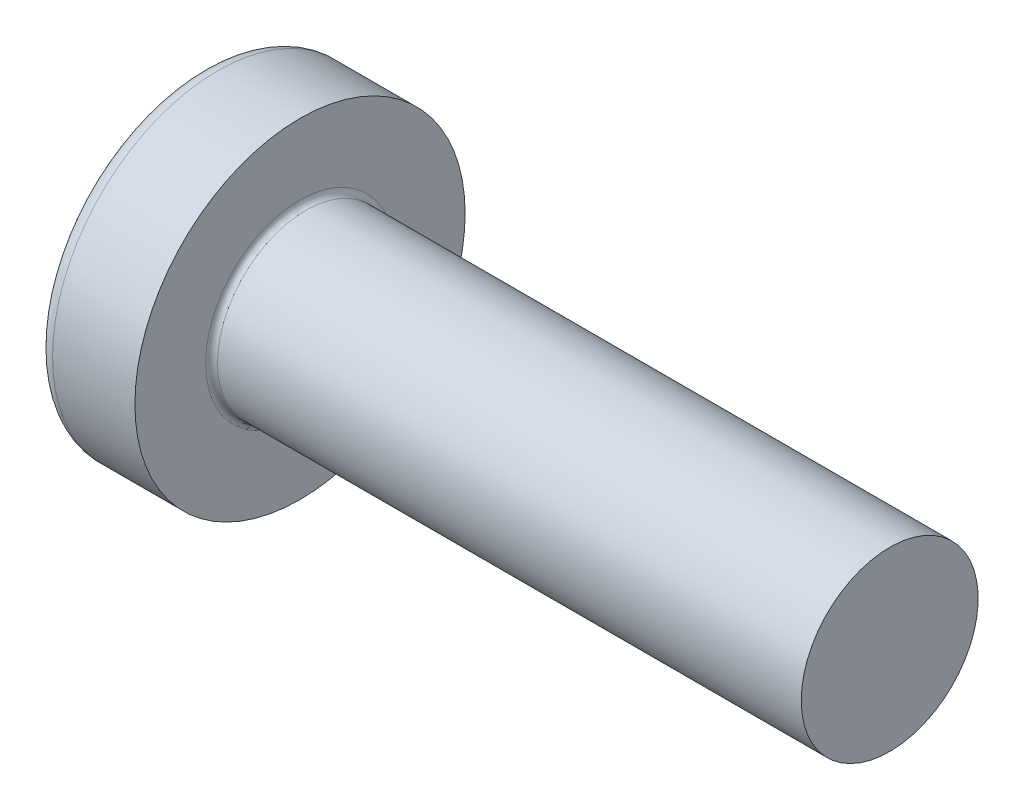
ISO-10303-21;
HEADER;
FILE_DESCRIPTION(('STEP AP214'),'2;1');
FILE_NAME('part.step','',(''),(''),'','','');
FILE_SCHEMA(('AUTOMOTIVE_DESIGN { 1 0 10303 214 1 1 1 1 }'));
ENDSEC;
DATA;
#1=APPLICATION_CONTEXT('core data for automotive mechanical design processes');
#2=APPLICATION_PROTOCOL_DEFINITION('international standard','automotive_design',2000,#1);
#3=PRODUCT_CONTEXT('',#1,'mechanical');
#4=PRODUCT('Part','Part','',(#3));
#5=PRODUCT_RELATED_PRODUCT_CATEGORY('part','',(#4));
#6=PRODUCT_DEFINITION_FORMATION('','',#4);
#7=PRODUCT_DEFINITION_CONTEXT('part definition',#1,'design');
#8=PRODUCT_DEFINITION('design','',#6,#7);
#9=PRODUCT_DEFINITION_SHAPE('','',#8);
#10=(LENGTH_UNIT() NAMED_UNIT(*) SI_UNIT(.MILLI.,.METRE.));
#11=(NAMED_UNIT(*) PLANE_ANGLE_UNIT() SI_UNIT($,.RADIAN.));
#12=(NAMED_UNIT(*) SI_UNIT($,.STERADIAN.) SOLID_ANGLE_UNIT());
#13=UNCERTAINTY_MEASURE_WITH_UNIT(LENGTH_MEASURE(1.E-05),#10,'distance_accuracy_value','');
#14=(GEOMETRIC_REPRESENTATION_CONTEXT(3) GLOBAL_UNCERTAINTY_ASSIGNED_CONTEXT((#13)) GLOBAL_UNIT_ASSIGNED_CONTEXT((#10,
#11,#12)) REPRESENTATION_CONTEXT('',''));
#15=CARTESIAN_POINT('',(0.,0.,0.));
#16=DIRECTION('',(0.,0.,1.));
#17=DIRECTION('',(1.,0.,0.));
#18=AXIS2_PLACEMENT_3D('',#15,#16,#17);
#19=CARTESIAN_POINT('',(5.,0.,0.));
#20=DIRECTION('',(-1.,0.,0.));
#21=DIRECTION('',(0.,1.,0.));
#22=AXIS2_PLACEMENT_3D('',#19,#20,#21);
#23=SPHERICAL_SURFACE('',#22,5.);
#24=CARTESIAN_POINT('',(0.775371598933733,0.,0.));
#25=DIRECTION('',(-1.,0.,0.));
#26=DIRECTION('',(0.,0.,1.));
#27=AXIS2_PLACEMENT_3D('',#24,#25,#26);
#28=CIRCLE('',#27,2.67441860465116);
#29=CARTESIAN_POINT('',(0.775371598933733,0.,2.67441860465116));
#30=VERTEX_POINT('',#29);
#31=EDGE_CURVE('E242',#30,#30,#28,.T.);
#32=ORIENTED_EDGE('',*,*,#31,.T.);
#33=EDGE_LOOP('',(#32));
#34=FACE_BOUND('',#33,.T.);
#35=CARTESIAN_POINT('',(0.0457951200896417,0.,0.));
#36=DIRECTION('',(1.,0.,0.));
#37=DIRECTION('',(0.,0.,-1.));
#38=AXIS2_PLACEMENT_3D('',#35,#36,#37);
#39=CIRCLE('',#38,0.675169614150692);
#40=CARTESIAN_POINT('',(0.0457951200896426,-0.369999999999998,-0.564760133040918));
#41=VERTEX_POINT('',#40);
#42=CARTESIAN_POINT('',(0.0457951200896417,-0.564760133040916,-0.37));
#43=VERTEX_POINT('',#42);
#44=EDGE_CURVE('E378',#41,#43,#39,.F.);
#45=ORIENTED_EDGE('',*,*,#44,.F.);
#46=CARTESIAN_POINT('',(5.,-0.37,0.));
#47=DIRECTION('',(0.,1.,0.));
#48=DIRECTION('',(0.,0.,1.));
#49=AXIS2_PLACEMENT_3D('',#46,#47,#48);
#50=CIRCLE('',#49,4.98629120689917);
#51=CARTESIAN_POINT('',(0.187869734228639,-0.369999999999995,-1.30633162146802));
#52=VERTEX_POINT('',#51);
#53=EDGE_CURVE('E304',#52,#41,#50,.T.);
#54=ORIENTED_EDGE('',*,*,#53,.F.);
#55=CARTESIAN_POINT('',(4.56358262530798,0.,0.875317983305919));
#56=DIRECTION('',(0.446197753347436,0.,-0.894934391398443));
#57=DIRECTION('',(-0.894934391398443,0.,-0.446197753347436));
#58=AXIS2_PLACEMENT_3D('',#55,#56,#57);
#59=CIRCLE('',#58,4.90340272700175);
#60=CARTESIAN_POINT('',(0.18786973422864,0.370000000000005,-1.30633162146802));
#61=VERTEX_POINT('',#60);
#62=EDGE_CURVE('E276',#52,#61,#59,.T.);
#63=ORIENTED_EDGE('',*,*,#62,.T.);
#64=CARTESIAN_POINT('',(5.,0.37,0.));
#65=DIRECTION('',(0.,-1.,0.));
#66=DIRECTION('',(0.,0.,-1.));
#67=AXIS2_PLACEMENT_3D('',#64,#65,#66);
#68=CIRCLE('',#67,4.98629120689917);
#69=CARTESIAN_POINT('',(0.0457951200896425,0.370000000000002,-0.564760133040916));
#70=VERTEX_POINT('',#69);
#71=EDGE_CURVE('E331',#70,#61,#68,.T.);
#72=ORIENTED_EDGE('',*,*,#71,.F.);
#73=CARTESIAN_POINT('',(0.0457951200896417,0.564760133040915,-0.37));
#74=VERTEX_POINT('',#73);
#75=EDGE_CURVE('E397',#74,#70,#39,.F.);
#76=ORIENTED_EDGE('',*,*,#75,.F.);
#77=CARTESIAN_POINT('',(5.,0.,-0.37));
#78=DIRECTION('',(0.,0.,1.));
#79=DIRECTION('',(1.,0.,0.));
#80=AXIS2_PLACEMENT_3D('',#77,#78,#79);
#81=CIRCLE('',#80,4.98629120689917);
#82=CARTESIAN_POINT('',(0.187869734228641,1.30633162146802,-0.37));
#83=VERTEX_POINT('',#82);
#84=EDGE_CURVE('E270',#83,#74,#81,.T.);
#85=ORIENTED_EDGE('',*,*,#84,.F.);
#86=CARTESIAN_POINT('',(4.56358262530798,-0.87531798330592,0.));
#87=DIRECTION('',(0.446197753347436,0.894934391398443,0.));
#88=DIRECTION('',(-0.894934391398442,0.446197753347436,0.));
#89=AXIS2_PLACEMENT_3D('',#86,#87,#88);
#90=CIRCLE('',#89,4.90340272700175);
#91=CARTESIAN_POINT('',(0.18786973422864,1.30633162146802,0.37));
#92=VERTEX_POINT('',#91);
#93=EDGE_CURVE('E273',#83,#92,#90,.T.);
#94=ORIENTED_EDGE('',*,*,#93,.T.);
#95=CARTESIAN_POINT('',(5.,0.,0.37));
#96=DIRECTION('',(0.,0.,-1.));
#97=DIRECTION('',(0.,1.,0.));
#98=AXIS2_PLACEMENT_3D('',#95,#96,#97);
#99=CIRCLE('',#98,4.98629120689917);
#100=CARTESIAN_POINT('',(0.0457951200896417,0.564760133040915,0.37));
#101=VERTEX_POINT('',#100);
#102=EDGE_CURVE('E266',#101,#92,#99,.T.);
#103=ORIENTED_EDGE('',*,*,#102,.F.);
#104=CARTESIAN_POINT('',(0.0457951200896434,0.369999999999998,0.564760133040918));
#105=VERTEX_POINT('',#104);
#106=EDGE_CURVE('E396',#105,#101,#39,.F.);
#107=ORIENTED_EDGE('',*,*,#106,.F.);
#108=CARTESIAN_POINT('',(0.18786973422864,0.369999999999995,1.30633162146802));
#109=VERTEX_POINT('',#108);
#110=EDGE_CURVE('E286',#109,#105,#68,.T.);
#111=ORIENTED_EDGE('',*,*,#110,.F.);
#112=CARTESIAN_POINT('',(4.56358262530798,0.,-0.87531798330592));
#113=DIRECTION('',(0.446197753347436,0.,0.894934391398443));
#114=DIRECTION('',(0.894934391398442,0.,-0.446197753347436));
#115=AXIS2_PLACEMENT_3D('',#112,#113,#114);
#116=CIRCLE('',#115,4.90340272700175);
#117=CARTESIAN_POINT('',(0.18786973422864,-0.370000000000005,1.30633162146802));
#118=VERTEX_POINT('',#117);
#119=EDGE_CURVE('E53',#109,#118,#116,.T.);
#120=ORIENTED_EDGE('',*,*,#119,.T.);
#121=CARTESIAN_POINT('',(0.0457951200896421,-0.370000000000002,0.564760133040916));
#122=VERTEX_POINT('',#121);
#123=EDGE_CURVE('E283',#122,#118,#50,.T.);
#124=ORIENTED_EDGE('',*,*,#123,.F.);
#125=CARTESIAN_POINT('',(0.0457951200896417,-0.564760133040916,0.37));
#126=VERTEX_POINT('',#125);
#127=EDGE_CURVE('E436',#126,#122,#39,.F.);
#128=ORIENTED_EDGE('',*,*,#127,.F.);
#129=CARTESIAN_POINT('',(0.187869734228639,-1.30633162146802,0.37));
#130=VERTEX_POINT('',#129);
#131=EDGE_CURVE('E267',#130,#126,#99,.T.);
#132=ORIENTED_EDGE('',*,*,#131,.F.);
#133=CARTESIAN_POINT('',(4.56358262530798,0.875317983305919,0.));
#134=DIRECTION('',(0.446197753347436,-0.894934391398443,0.));
#135=DIRECTION('',(0.894934391398443,0.446197753347436,0.));
#136=AXIS2_PLACEMENT_3D('',#133,#134,#135);
#137=CIRCLE('',#136,4.90340272700175);
#138=CARTESIAN_POINT('',(0.18786973422864,-1.30633162146802,-0.37));
#139=VERTEX_POINT('',#138);
#140=EDGE_CURVE('E263',#130,#139,#137,.T.);
#141=ORIENTED_EDGE('',*,*,#140,.T.);
#142=EDGE_CURVE('E68',#43,#139,#81,.T.);
#143=ORIENTED_EDGE('',*,*,#142,.F.);
#144=EDGE_LOOP('',(#45,#54,#63,#72,#76,#85,#94,#103,#107,#111,#120,#124,#128,#132,#141,#143));
#145=FACE_BOUND('',#144,.T.);
#146=ADVANCED_FACE('F39',(#34,#145),#23,.T.);
#147=CARTESIAN_POINT('',(1.75,0.527482331818931,-0.37));
#148=DIRECTION('',(0.,0.,1.));
#149=DIRECTION('',(1.,0.,0.));
#150=AXIS2_PLACEMENT_3D('',#147,#148,#149);
#151=PLANE('',#150);
#152=ORIENTED_EDGE('',*,*,#84,.T.);
#153=CARTESIAN_POINT('',(-0.987293237053716,0.649401255967161,-0.37));
#154=CARTESIAN_POINT('',(-0.781914975317084,0.632865887002871,-0.37));
#155=CARTESIAN_POINT('',(-0.576547882393372,0.616188977635081,-0.37));
#156=CARTESIAN_POINT('',(-0.165841599226327,0.582441031964227,-0.37));
#157=CARTESIAN_POINT('',(0.0394975903090452,0.56536998705488,-0.37));
#158=CARTESIAN_POINT('',(0.450133475422572,0.530723441326535,-0.37));
#159=CARTESIAN_POINT('',(0.655430171010573,0.513147940624557,-0.37));
#160=CARTESIAN_POINT('',(1.06596140177934,0.477314957985794,-0.37));
#161=CARTESIAN_POINT('',(1.2711959378071,0.459057485806066,-0.37));
#162=CARTESIAN_POINT('',(1.61065292365626,0.428051938688768,-0.37));
#163=CARTESIAN_POINT('',(1.74490059995643,0.415580824990931,-0.37));
#164=CARTESIAN_POINT('',(2.01334321762763,0.390092023404979,-0.37));
#165=CARTESIAN_POINT('',(2.14753815934577,0.377074339177353,-0.37));
#166=CARTESIAN_POINT('',(2.41586354151957,0.350315629452843,-0.37));
#167=CARTESIAN_POINT('',(2.5499939784531,0.33657456817765,-0.37));
#168=CARTESIAN_POINT('',(2.81814173295471,0.308004077741875,-0.37));
#169=CARTESIAN_POINT('',(2.95215904765134,0.293174621747065,-0.37));
#170=CARTESIAN_POINT('',(3.0860955068368,0.277618485071816,-0.37));
#171=B_SPLINE_CURVE_WITH_KNOTS('',3,(#153,#154,#155,#156,#157,#158,#159,#160,#161,#162,#163,
#164,#165,#166,#167,#168,#169,#170),.UNSPECIFIED.,.F.,.F.,(4,2,2,2,2,2,2,2,4),(0.,
0.618128793984691,1.23627109812525,1.85441325887562,2.4725465791681,2.87702276218609,
3.28149623678161,3.68598973550942,4.09049321032311),.UNSPECIFIED.);
#172=CARTESIAN_POINT('',(1.75,0.415013252800437,-0.370000000000001));
#173=VERTEX_POINT('',#172);
#174=EDGE_CURVE('E420',#74,#173,#171,.T.);
#175=ORIENTED_EDGE('',*,*,#174,.T.);
#176=DIRECTION('',(0.,1.,0.));
#177=VECTOR('',#176,1.);
#178=CARTESIAN_POINT('',(1.75,-0.527482331818931,-0.37));
#179=LINE('',#178,#177);
#180=CARTESIAN_POINT('',(1.75,0.527482331818931,-0.37));
#181=VERTEX_POINT('',#180);
#182=EDGE_CURVE('E360',#173,#181,#179,.T.);
#183=ORIENTED_EDGE('',*,*,#182,.T.);
#184=DIRECTION('',(0.894934391398442,-0.446197753347436,0.));
#185=VECTOR('',#184,1.);
#186=CARTESIAN_POINT('',(0.,1.4,-0.37));
#187=LINE('',#186,#185);
#188=EDGE_CURVE('E243',#83,#181,#187,.T.);
#189=ORIENTED_EDGE('',*,*,#188,.F.);
#190=EDGE_LOOP('',(#152,#175,#183,#189));
#191=FACE_BOUND('',#190,.T.);
#192=ADVANCED_FACE('F198',(#191),#151,.T.);
#193=CARTESIAN_POINT('',(1.75,-0.527482331818931,-0.37));
#194=VERTEX_POINT('',#193);
#195=CARTESIAN_POINT('',(1.75,-0.415013252800437,-0.370000000000001));
#196=VERTEX_POINT('',#195);
#197=EDGE_CURVE('E251',#194,#196,#179,.T.);
#198=ORIENTED_EDGE('',*,*,#197,.T.);
#199=CARTESIAN_POINT('',(-0.987293237053716,-0.649401255967161,-0.37));
#200=CARTESIAN_POINT('',(-0.781914975317084,-0.632865887002871,-0.37));
#201=CARTESIAN_POINT('',(-0.576547882393372,-0.616188977635081,-0.37));
#202=CARTESIAN_POINT('',(-0.165841599226327,-0.582441031964227,-0.37));
#203=CARTESIAN_POINT('',(0.0394975903090452,-0.56536998705488,-0.37));
#204=CARTESIAN_POINT('',(0.450133475422572,-0.530723441326535,-0.37));
#205=CARTESIAN_POINT('',(0.655430171010573,-0.513147940624557,-0.37));
#206=CARTESIAN_POINT('',(1.06596140177934,-0.477314957985794,-0.37));
#207=CARTESIAN_POINT('',(1.2711959378071,-0.459057485806066,-0.37));
#208=CARTESIAN_POINT('',(1.61065292365626,-0.428051938688768,-0.37));
#209=CARTESIAN_POINT('',(1.74490059995643,-0.415580824990931,-0.37));
#210=CARTESIAN_POINT('',(2.01334321762763,-0.390092023404979,-0.37));
#211=CARTESIAN_POINT('',(2.14753815934577,-0.377074339177353,-0.37));
#212=CARTESIAN_POINT('',(2.41586354151957,-0.350315629452843,-0.37));
#213=CARTESIAN_POINT('',(2.5499939784531,-0.33657456817765,-0.37));
#214=CARTESIAN_POINT('',(2.81814173295471,-0.308004077741875,-0.37));
#215=CARTESIAN_POINT('',(2.95215904765134,-0.293174621747065,-0.37));
#216=CARTESIAN_POINT('',(3.0860955068368,-0.277618485071816,-0.37));
#217=B_SPLINE_CURVE_WITH_KNOTS('',3,(#199,#200,#201,#202,#203,#204,#205,#206,#207,#208,#209,
#210,#211,#212,#213,#214,#215,#216),.UNSPECIFIED.,.F.,.F.,(4,2,2,2,2,2,2,2,4),(0.,
0.618128793984691,1.23627109812525,1.85441325887562,2.4725465791681,2.87702276218609,
3.28149623678161,3.68598973550942,4.09049321032311),.UNSPECIFIED.);
#218=EDGE_CURVE('E395',#196,#43,#217,.F.);
#219=ORIENTED_EDGE('',*,*,#218,.T.);
#220=ORIENTED_EDGE('',*,*,#142,.T.);
#221=DIRECTION('',(0.894934391398442,0.446197753347436,0.));
#222=VECTOR('',#221,1.);
#223=CARTESIAN_POINT('',(0.,-1.4,-0.37));
#224=LINE('',#223,#222);
#225=EDGE_CURVE('E334',#139,#194,#224,.T.);
#226=ORIENTED_EDGE('',*,*,#225,.T.);
#227=EDGE_LOOP('',(#198,#219,#220,#226));
#228=FACE_BOUND('',#227,.T.);
#229=ADVANCED_FACE('F204',(#228),#151,.T.);
#230=CARTESIAN_POINT('',(1.75,-0.527482331818931,0.37));
#231=DIRECTION('',(0.,0.,-1.));
#232=DIRECTION('',(0.,1.,0.));
#233=AXIS2_PLACEMENT_3D('',#230,#231,#232);
#234=PLANE('',#233);
#235=DIRECTION('',(0.,-1.,0.));
#236=VECTOR('',#235,1.);
#237=CARTESIAN_POINT('',(1.75,0.527482331818931,0.37));
#238=LINE('',#237,#236);
#239=CARTESIAN_POINT('',(1.75,0.527482331818931,0.37));
#240=VERTEX_POINT('',#239);
#241=CARTESIAN_POINT('',(1.75,0.415013252800437,0.370000000000001));
#242=VERTEX_POINT('',#241);
#243=EDGE_CURVE('E343',#240,#242,#238,.T.);
#244=ORIENTED_EDGE('',*,*,#243,.T.);
#245=CARTESIAN_POINT('',(-0.987293237053716,0.649401255967161,0.37));
#246=CARTESIAN_POINT('',(-0.781914975317084,0.632865887002871,0.37));
#247=CARTESIAN_POINT('',(-0.576547882393372,0.616188977635081,0.37));
#248=CARTESIAN_POINT('',(-0.165841599226327,0.582441031964227,0.37));
#249=CARTESIAN_POINT('',(0.0394975903090453,0.56536998705488,0.37));
#250=CARTESIAN_POINT('',(0.450133475422572,0.530723441326535,0.37));
#251=CARTESIAN_POINT('',(0.655430171010574,0.513147940624557,0.37));
#252=CARTESIAN_POINT('',(1.06596140177934,0.477314957985794,0.37));
#253=CARTESIAN_POINT('',(1.2711959378071,0.459057485806066,0.37));
#254=CARTESIAN_POINT('',(1.61065292365626,0.428051938688768,0.37));
#255=CARTESIAN_POINT('',(1.74490059995643,0.415580824990931,0.37));
#256=CARTESIAN_POINT('',(2.01334321762763,0.39009202340498,0.37));
#257=CARTESIAN_POINT('',(2.14753815934577,0.377074339177353,0.37));
#258=CARTESIAN_POINT('',(2.41586354151957,0.350315629452843,0.37));
#259=CARTESIAN_POINT('',(2.5499939784531,0.33657456817765,0.37));
#260=CARTESIAN_POINT('',(2.81814173295471,0.308004077741875,0.37));
#261=CARTESIAN_POINT('',(2.95215904765134,0.293174621747065,0.37));
#262=CARTESIAN_POINT('',(3.0860955068368,0.277618485071816,0.37));
#263=B_SPLINE_CURVE_WITH_KNOTS('',3,(#245,#246,#247,#248,#249,#250,#251,#252,#253,#254,#255,
#256,#257,#258,#259,#260,#261,#262),.UNSPECIFIED.,.F.,.F.,(4,2,2,2,2,2,2,2,4),(0.,
0.618128793984691,1.23627109812525,1.85441325887562,2.4725465791681,2.87702276218609,
3.28149623678161,3.68598973550942,4.09049321032311),.UNSPECIFIED.);
#264=EDGE_CURVE('E675',#242,#101,#263,.F.);
#265=ORIENTED_EDGE('',*,*,#264,.T.);
#266=ORIENTED_EDGE('',*,*,#102,.T.);
#267=DIRECTION('',(0.894934391398442,-0.446197753347436,0.));
#268=VECTOR('',#267,1.);
#269=CARTESIAN_POINT('',(0.,1.4,0.37));
#270=LINE('',#269,#268);
#271=EDGE_CURVE('E248',#92,#240,#270,.T.);
#272=ORIENTED_EDGE('',*,*,#271,.T.);
#273=EDGE_LOOP('',(#244,#265,#266,#272));
#274=FACE_BOUND('',#273,.T.);
#275=ADVANCED_FACE('F416',(#274),#234,.T.);
#276=ORIENTED_EDGE('',*,*,#131,.T.);
#277=CARTESIAN_POINT('',(-0.987293237069635,-0.649401255968442,0.37));
#278=CARTESIAN_POINT('',(-0.781914975331301,-0.632865887004023,0.37));
#279=CARTESIAN_POINT('',(-0.576547882405888,-0.616188977636102,0.37));
#280=CARTESIAN_POINT('',(-0.16584159923544,-0.582441031964983,0.37));
#281=CARTESIAN_POINT('',(0.0394975903016338,-0.5653699870555,0.37));
#282=CARTESIAN_POINT('',(0.450133475420601,-0.530723441326706,0.37));
#283=CARTESIAN_POINT('',(0.655430171012341,-0.513147940624409,0.37));
#284=CARTESIAN_POINT('',(1.06596140178858,-0.477314957984981,0.37));
#285=CARTESIAN_POINT('',(1.27119593782008,-0.459057485804908,0.37));
#286=CARTESIAN_POINT('',(1.61065292367297,-0.428051938687225,0.37));
#287=CARTESIAN_POINT('',(1.74490059997313,-0.415580824989368,0.37));
#288=CARTESIAN_POINT('',(2.01334321764434,-0.390092023403371,0.37));
#289=CARTESIAN_POINT('',(2.14753815936247,-0.377074339175718,0.37));
#290=CARTESIAN_POINT('',(2.41586354153627,-0.350315629451146,0.37));
#291=CARTESIAN_POINT('',(2.54999397846979,-0.336574568175918,0.37));
#292=CARTESIAN_POINT('',(2.8181417329714,-0.308004077740054,0.37));
#293=CARTESIAN_POINT('',(2.95215904766802,-0.29317462174519,0.37));
#294=CARTESIAN_POINT('',(3.08609550685347,-0.277618485069873,0.37));
#295=B_SPLINE_CURVE_WITH_KNOTS('',3,(#277,#278,#279,#280,#281,#282,#283,#284,#285,#286,#287,
#288,#289,#290,#291,#292,#293,#294),.UNSPECIFIED.,.F.,.F.,(4,2,2,2,2,2,2,2,4),(0.,
0.61812879398981,1.23627109813549,1.85441325889711,2.47254657920086,2.87702276221884,
3.28149623681437,3.68598973554218,4.09049321035586),.UNSPECIFIED.);
#296=CARTESIAN_POINT('',(1.75,-0.415013252800437,0.37));
#297=VERTEX_POINT('',#296);
#298=EDGE_CURVE('E437',#126,#297,#295,.T.);
#299=ORIENTED_EDGE('',*,*,#298,.T.);
#300=CARTESIAN_POINT('',(1.75,-0.527482331818932,0.37));
#301=VERTEX_POINT('',#300);
#302=EDGE_CURVE('E345',#297,#301,#238,.T.);
#303=ORIENTED_EDGE('',*,*,#302,.T.);
#304=DIRECTION('',(0.894934391398443,0.446197753347436,0.));
#305=VECTOR('',#304,1.);
#306=CARTESIAN_POINT('',(0.,-1.4,0.37));
#307=LINE('',#306,#305);
#308=EDGE_CURVE('E336',#130,#301,#307,.T.);
#309=ORIENTED_EDGE('',*,*,#308,.F.);
#310=EDGE_LOOP('',(#276,#299,#303,#309));
#311=FACE_BOUND('',#310,.T.);
#312=ADVANCED_FACE('F523',(#311),#234,.T.);
#313=CARTESIAN_POINT('',(1.75,0.527482331818931,0.37));
#314=DIRECTION('',(0.446197753347436,0.894934391398443,0.));
#315=DIRECTION('',(-0.894934391398442,0.446197753347436,0.));
#316=AXIS2_PLACEMENT_3D('',#313,#314,#315);
#317=PLANE('',#316);
#318=CARTESIAN_POINT('',(2.6696526882832,0.0689604923233249,0.));
#319=DIRECTION('',(0.446197753347436,0.894934391398443,0.));
#320=DIRECTION('',(-0.894934391398443,0.446197753347436,0.));
#321=AXIS2_PLACEMENT_3D('',#318,#319,#320);
#322=ELLIPSE('',#321,1.10195897609154,0.486831694838766);
#323=CARTESIAN_POINT('',(1.75,0.527482331818932,0.175779377683682));
#324=VERTEX_POINT('',#323);
#325=CARTESIAN_POINT('',(1.75,0.527482331818932,-0.175779377683682));
#326=VERTEX_POINT('',#325);
#327=EDGE_CURVE('E309',#324,#326,#322,.F.);
#328=ORIENTED_EDGE('',*,*,#327,.F.);
#329=DIRECTION('',(0.,0.,-1.));
#330=VECTOR('',#329,1.);
#331=CARTESIAN_POINT('',(1.75,0.527482331818931,0.37));
#332=LINE('',#331,#330);
#333=EDGE_CURVE('E346',#240,#324,#332,.T.);
#334=ORIENTED_EDGE('',*,*,#333,.F.);
#335=ORIENTED_EDGE('',*,*,#271,.F.);
#336=ORIENTED_EDGE('',*,*,#93,.F.);
#337=ORIENTED_EDGE('',*,*,#188,.T.);
#338=EDGE_CURVE('E348',#326,#181,#332,.T.);
#339=ORIENTED_EDGE('',*,*,#338,.F.);
#340=EDGE_LOOP('',(#328,#334,#335,#336,#337,#339));
#341=FACE_BOUND('',#340,.T.);
#342=ADVANCED_FACE('F414',(#341),#317,.F.);
#343=CARTESIAN_POINT('',(0.,-1.4,-0.37));
#344=DIRECTION('',(0.446197753347436,-0.894934391398443,0.));
#345=DIRECTION('',(0.894934391398443,0.446197753347436,0.));
#346=AXIS2_PLACEMENT_3D('',#343,#344,#345);
#347=PLANE('',#346);
#348=CARTESIAN_POINT('',(2.6696526882832,-0.0689604923233252,0.));
#349=DIRECTION('',(0.446197753347436,-0.894934391398443,0.));
#350=DIRECTION('',(-0.894934391398443,-0.446197753347436,0.));
#351=AXIS2_PLACEMENT_3D('',#348,#349,#350);
#352=ELLIPSE('',#351,1.10195897609154,0.486831694838766);
#353=CARTESIAN_POINT('',(1.75,-0.527482331818932,-0.175779377683681));
#354=VERTEX_POINT('',#353);
#355=CARTESIAN_POINT('',(1.75,-0.527482331818932,0.17577937768368));
#356=VERTEX_POINT('',#355);
#357=EDGE_CURVE('E677',#354,#356,#352,.F.);
#358=ORIENTED_EDGE('',*,*,#357,.F.);
#359=DIRECTION('',(0.,0.,1.));
#360=VECTOR('',#359,1.);
#361=CARTESIAN_POINT('',(1.75,-0.527482331818931,-0.37));
#362=LINE('',#361,#360);
#363=EDGE_CURVE('E339',#194,#354,#362,.T.);
#364=ORIENTED_EDGE('',*,*,#363,.F.);
#365=ORIENTED_EDGE('',*,*,#225,.F.);
#366=ORIENTED_EDGE('',*,*,#140,.F.);
#367=ORIENTED_EDGE('',*,*,#308,.T.);
#368=EDGE_CURVE('E342',#356,#301,#362,.T.);
#369=ORIENTED_EDGE('',*,*,#368,.F.);
#370=EDGE_LOOP('',(#358,#364,#365,#366,#367,#369));
#371=FACE_BOUND('',#370,.T.);
#372=ADVANCED_FACE('F510',(#371),#347,.F.);
#373=CARTESIAN_POINT('',(1.75,0.527482331818931,-0.37));
#374=DIRECTION('',(-1.,0.,0.));
#375=DIRECTION('',(0.,0.,1.));
#376=AXIS2_PLACEMENT_3D('',#373,#374,#375);
#377=PLANE('',#376);
#378=DIRECTION('',(0.,1.,0.));
#379=VECTOR('',#378,1.);
#380=CARTESIAN_POINT('',(1.75,-0.370000000000002,0.52748233181893));
#381=LINE('',#380,#379);
#382=CARTESIAN_POINT('',(1.75,-0.370000000000002,0.52748233181893));
#383=VERTEX_POINT('',#382);
#384=CARTESIAN_POINT('',(1.75,-0.175779377683686,0.52748233181893));
#385=VERTEX_POINT('',#384);
#386=EDGE_CURVE('E324',#383,#385,#381,.T.);
#387=ORIENTED_EDGE('',*,*,#386,.T.);
#388=CARTESIAN_POINT('',(1.75,0.,0.));
#389=DIRECTION('',(-1.,0.,0.));
#390=DIRECTION('',(0.,0.,1.));
#391=AXIS2_PLACEMENT_3D('',#388,#389,#390);
#392=CIRCLE('',#391,0.556);
#393=CARTESIAN_POINT('',(1.75,-0.370000000000001,0.415013252800436));
#394=VERTEX_POINT('',#393);
#395=EDGE_CURVE('E705',#394,#385,#392,.T.);
#396=ORIENTED_EDGE('',*,*,#395,.F.);
#397=DIRECTION('',(0.,0.,-1.));
#398=VECTOR('',#397,1.);
#399=CARTESIAN_POINT('',(1.75,-0.370000000000002,0.52748233181893));
#400=LINE('',#399,#398);
#401=EDGE_CURVE('E320',#383,#394,#400,.T.);
#402=ORIENTED_EDGE('',*,*,#401,.F.);
#403=EDGE_LOOP('',(#387,#396,#402));
#404=FACE_BOUND('',#403,.T.);
#405=ADVANCED_FACE('F503',(#404),#377,.T.);
#406=ORIENTED_EDGE('',*,*,#302,.F.);
#407=EDGE_CURVE('E710',#356,#297,#392,.T.);
#408=ORIENTED_EDGE('',*,*,#407,.F.);
#409=ORIENTED_EDGE('',*,*,#368,.T.);
#410=EDGE_LOOP('',(#406,#408,#409));
#411=FACE_BOUND('',#410,.T.);
#412=ADVANCED_FACE('F496',(#411),#377,.T.);
#413=ORIENTED_EDGE('',*,*,#363,.T.);
#414=EDGE_CURVE('E389',#196,#354,#392,.T.);
#415=ORIENTED_EDGE('',*,*,#414,.F.);
#416=ORIENTED_EDGE('',*,*,#197,.F.);
#417=EDGE_LOOP('',(#413,#415,#416));
#418=FACE_BOUND('',#417,.T.);
#419=ADVANCED_FACE('F490',(#418),#377,.T.);
#420=CARTESIAN_POINT('',(1.75,-0.369999999999998,-0.415013252800438));
#421=VERTEX_POINT('',#420);
#422=CARTESIAN_POINT('',(1.75,-0.369999999999998,-0.527482331818933));
#423=VERTEX_POINT('',#422);
#424=EDGE_CURVE('E323',#421,#423,#400,.T.);
#425=ORIENTED_EDGE('',*,*,#424,.F.);
#426=CARTESIAN_POINT('',(1.75,-0.17577937768368,-0.527482331818932));
#427=VERTEX_POINT('',#426);
#428=EDGE_CURVE('E60',#427,#421,#392,.T.);
#429=ORIENTED_EDGE('',*,*,#428,.F.);
#430=DIRECTION('',(0.,-1.,0.));
#431=VECTOR('',#430,1.);
#432=CARTESIAN_POINT('',(1.75,0.370000000000002,-0.52748233181893));
#433=LINE('',#432,#431);
#434=EDGE_CURVE('E319',#427,#423,#433,.T.);
#435=ORIENTED_EDGE('',*,*,#434,.T.);
#436=EDGE_LOOP('',(#425,#429,#435));
#437=FACE_BOUND('',#436,.T.);
#438=ADVANCED_FACE('F384',(#437),#377,.T.);
#439=CARTESIAN_POINT('',(1.75,0.370000000000002,-0.52748233181893));
#440=VERTEX_POINT('',#439);
#441=CARTESIAN_POINT('',(1.75,0.175779377683684,-0.527482331818931));
#442=VERTEX_POINT('',#441);
#443=EDGE_CURVE('E316',#440,#442,#433,.T.);
#444=ORIENTED_EDGE('',*,*,#443,.T.);
#445=CARTESIAN_POINT('',(1.75,0.370000000000001,-0.415013252800436));
#446=VERTEX_POINT('',#445);
#447=EDGE_CURVE('E388',#446,#442,#392,.T.);
#448=ORIENTED_EDGE('',*,*,#447,.F.);
#449=DIRECTION('',(0.,0.,1.));
#450=VECTOR('',#449,1.);
#451=CARTESIAN_POINT('',(1.75,0.370000000000002,-0.52748233181893));
#452=LINE('',#451,#450);
#453=EDGE_CURVE('E328',#440,#446,#452,.T.);
#454=ORIENTED_EDGE('',*,*,#453,.F.);
#455=EDGE_LOOP('',(#444,#448,#454));
#456=FACE_BOUND('',#455,.T.);
#457=ADVANCED_FACE('F478',(#456),#377,.T.);
#458=ORIENTED_EDGE('',*,*,#182,.F.);
#459=EDGE_CURVE('E694',#326,#173,#392,.T.);
#460=ORIENTED_EDGE('',*,*,#459,.F.);
#461=ORIENTED_EDGE('',*,*,#338,.T.);
#462=EDGE_LOOP('',(#458,#460,#461));
#463=FACE_BOUND('',#462,.T.);
#464=ADVANCED_FACE('F471',(#463),#377,.T.);
#465=ORIENTED_EDGE('',*,*,#333,.T.);
#466=EDGE_CURVE('E696',#242,#324,#392,.T.);
#467=ORIENTED_EDGE('',*,*,#466,.F.);
#468=ORIENTED_EDGE('',*,*,#243,.F.);
#469=EDGE_LOOP('',(#465,#467,#468));
#470=FACE_BOUND('',#469,.T.);
#471=ADVANCED_FACE('F465',(#470),#377,.T.);
#472=CARTESIAN_POINT('',(1.75,0.369999999999998,0.527482331818932));
#473=DIRECTION('',(0.,-1.,0.));
#474=DIRECTION('',(1.,0.,0.));
#475=AXIS2_PLACEMENT_3D('',#472,#473,#474);
#476=PLANE('',#475);
#477=ORIENTED_EDGE('',*,*,#110,.T.);
#478=CARTESIAN_POINT('',(-0.987293237069635,0.369999999999998,0.649401255968443));
#479=CARTESIAN_POINT('',(-0.781914975331301,0.369999999999998,0.632865887004024));
#480=CARTESIAN_POINT('',(-0.576547882405888,0.369999999999998,0.616188977636103));
#481=CARTESIAN_POINT('',(-0.16584159923544,0.369999999999998,0.582441031964984));
#482=CARTESIAN_POINT('',(0.0394975903016338,0.369999999999998,0.565369987055501));
#483=CARTESIAN_POINT('',(0.450133475420601,0.369999999999998,0.530723441326707));
#484=CARTESIAN_POINT('',(0.655430171012341,0.369999999999998,0.51314794062441));
#485=CARTESIAN_POINT('',(1.06596140178858,0.369999999999998,0.477314957984982));
#486=CARTESIAN_POINT('',(1.27119593782008,0.369999999999998,0.459057485804909));
#487=CARTESIAN_POINT('',(1.61065292367297,0.369999999999999,0.428051938687226));
#488=CARTESIAN_POINT('',(1.74490059997313,0.369999999999999,0.415580824989369));
#489=CARTESIAN_POINT('',(2.01334321764434,0.369999999999999,0.390092023403372));
#490=CARTESIAN_POINT('',(2.14753815936247,0.369999999999999,0.37707433917572));
#491=CARTESIAN_POINT('',(2.41586354153627,0.369999999999999,0.350315629451147));
#492=CARTESIAN_POINT('',(2.54999397846979,0.369999999999999,0.336574568175919));
#493=CARTESIAN_POINT('',(2.8181417329714,0.369999999999999,0.308004077740055));
#494=CARTESIAN_POINT('',(2.95215904766802,0.369999999999999,0.293174621745191));
#495=CARTESIAN_POINT('',(3.08609550685347,0.369999999999999,0.277618485069875));
#496=B_SPLINE_CURVE_WITH_KNOTS('',3,(#478,#479,#480,#481,#482,#483,#484,#485,#486,#487,#488,
#489,#490,#491,#492,#493,#494,#495),.UNSPECIFIED.,.F.,.F.,(4,2,2,2,2,2,2,2,4),(0.,
0.61812879398981,1.23627109813549,1.85441325889711,2.47254657920086,2.87702276221884,
3.28149623681436,3.68598973554218,4.09049321035586),.UNSPECIFIED.);
#497=CARTESIAN_POINT('',(1.75,0.369999999999999,0.415013252800439));
#498=VERTEX_POINT('',#497);
#499=EDGE_CURVE('E674',#105,#498,#496,.T.);
#500=ORIENTED_EDGE('',*,*,#499,.T.);
#501=CARTESIAN_POINT('',(1.75,0.369999999999998,0.527482331818932));
#502=VERTEX_POINT('',#501);
#503=EDGE_CURVE('E301',#498,#502,#452,.T.);
#504=ORIENTED_EDGE('',*,*,#503,.T.);
#505=DIRECTION('',(0.894934391398442,0.,-0.446197753347436));
#506=VECTOR('',#505,1.);
#507=CARTESIAN_POINT('',(0.,0.369999999999995,1.4));
#508=LINE('',#507,#506);
#509=EDGE_CURVE('E294',#109,#502,#508,.T.);
#510=ORIENTED_EDGE('',*,*,#509,.F.);
#511=EDGE_LOOP('',(#477,#500,#504,#510));
#512=FACE_BOUND('',#511,.T.);
#513=ADVANCED_FACE('F298',(#512),#476,.T.);
#514=CARTESIAN_POINT('',(1.75,-0.369999999999998,-0.527482331818933));
#515=DIRECTION('',(0.,1.,0.));
#516=DIRECTION('',(0.,0.,1.));
#517=AXIS2_PLACEMENT_3D('',#514,#515,#516);
#518=PLANE('',#517);
#519=ORIENTED_EDGE('',*,*,#401,.T.);
#520=CARTESIAN_POINT('',(-0.987293237053716,-0.370000000000002,0.64940125596716));
#521=CARTESIAN_POINT('',(-0.781914975317084,-0.370000000000002,0.63286588700287));
#522=CARTESIAN_POINT('',(-0.576547882393372,-0.370000000000002,0.61618897763508));
#523=CARTESIAN_POINT('',(-0.165841599226327,-0.370000000000002,0.582441031964225));
#524=CARTESIAN_POINT('',(0.0394975903090451,-0.370000000000002,0.565369987054878));
#525=CARTESIAN_POINT('',(0.450133475422572,-0.370000000000002,0.530723441326533));
#526=CARTESIAN_POINT('',(0.655430171010573,-0.370000000000002,0.513147940624555));
#527=CARTESIAN_POINT('',(1.06596140177934,-0.370000000000002,0.477314957985793));
#528=CARTESIAN_POINT('',(1.2711959378071,-0.370000000000002,0.459057485806065));
#529=CARTESIAN_POINT('',(1.61065292365626,-0.370000000000001,0.428051938688767));
#530=CARTESIAN_POINT('',(1.74490059995642,-0.370000000000001,0.41558082499093));
#531=CARTESIAN_POINT('',(2.01334321762763,-0.370000000000001,0.390092023404978));
#532=CARTESIAN_POINT('',(2.14753815934577,-0.370000000000001,0.377074339177352));
#533=CARTESIAN_POINT('',(2.41586354151957,-0.370000000000001,0.350315629452841));
#534=CARTESIAN_POINT('',(2.5499939784531,-0.370000000000001,0.336574568177649));
#535=CARTESIAN_POINT('',(2.81814173295471,-0.370000000000001,0.308004077741874));
#536=CARTESIAN_POINT('',(2.95215904765134,-0.370000000000001,0.293174621747063));
#537=CARTESIAN_POINT('',(3.0860955068368,-0.370000000000001,0.277618485071814));
#538=B_SPLINE_CURVE_WITH_KNOTS('',3,(#520,#521,#522,#523,#524,#525,#526,#527,#528,#529,#530,
#531,#532,#533,#534,#535,#536,#537),.UNSPECIFIED.,.F.,.F.,(4,2,2,2,2,2,2,2,4),(0.,
0.618128793984691,1.23627109812525,1.85441325887562,2.4725465791681,2.87702276218609,
3.28149623678161,3.68598973550942,4.09049321032311),.UNSPECIFIED.);
#539=EDGE_CURVE('E429',#394,#122,#538,.F.);
#540=ORIENTED_EDGE('',*,*,#539,.T.);
#541=ORIENTED_EDGE('',*,*,#123,.T.);
#542=DIRECTION('',(0.894934391398442,0.,-0.446197753347436));
#543=VECTOR('',#542,1.);
#544=CARTESIAN_POINT('',(0.,-0.370000000000005,1.4));
#545=LINE('',#544,#543);
#546=EDGE_CURVE('E296',#118,#383,#545,.T.);
#547=ORIENTED_EDGE('',*,*,#546,.T.);
#548=EDGE_LOOP('',(#519,#540,#541,#547));
#549=FACE_BOUND('',#548,.T.);
#550=ADVANCED_FACE('F233',(#549),#518,.T.);
#551=CARTESIAN_POINT('',(1.75,-0.370000000000002,0.52748233181893));
#552=DIRECTION('',(0.446197753347436,0.,0.894934391398443));
#553=DIRECTION('',(-0.894934391398442,0.,0.446197753347436));
#554=AXIS2_PLACEMENT_3D('',#551,#552,#553);
#555=PLANE('',#554);
#556=CARTESIAN_POINT('',(2.6696526882832,0.,0.0689604923233248));
#557=DIRECTION('',(0.446197753347436,0.,0.894934391398443));
#558=DIRECTION('',(-0.894934391398443,0.,0.446197753347436));
#559=AXIS2_PLACEMENT_3D('',#556,#557,#558);
#560=ELLIPSE('',#559,1.10195897609154,0.486831694838766);
#561=CARTESIAN_POINT('',(1.75,0.175779377683682,0.527482331818932));
#562=VERTEX_POINT('',#561);
#563=EDGE_CURVE('E427',#385,#562,#560,.F.);
#564=ORIENTED_EDGE('',*,*,#563,.F.);
#565=ORIENTED_EDGE('',*,*,#386,.F.);
#566=ORIENTED_EDGE('',*,*,#546,.F.);
#567=ORIENTED_EDGE('',*,*,#119,.F.);
#568=ORIENTED_EDGE('',*,*,#509,.T.);
#569=EDGE_CURVE('E327',#562,#502,#381,.T.);
#570=ORIENTED_EDGE('',*,*,#569,.F.);
#571=EDGE_LOOP('',(#564,#565,#566,#567,#568,#570));
#572=FACE_BOUND('',#571,.T.);
#573=ADVANCED_FACE('F292',(#572),#555,.F.);
#574=CARTESIAN_POINT('',(0.,0.370000000000005,-1.4));
#575=DIRECTION('',(0.446197753347436,0.,-0.894934391398443));
#576=DIRECTION('',(0.894934391398443,0.,0.446197753347436));
#577=AXIS2_PLACEMENT_3D('',#574,#575,#576);
#578=PLANE('',#577);
#579=CARTESIAN_POINT('',(2.6696526882832,0.,-0.0689604923233253));
#580=DIRECTION('',(0.446197753347436,0.,-0.894934391398443));
#581=DIRECTION('',(-0.894934391398443,0.,-0.446197753347436));
#582=AXIS2_PLACEMENT_3D('',#579,#580,#581);
#583=ELLIPSE('',#582,1.10195897609154,0.486831694838766);
#584=EDGE_CURVE('E382',#442,#427,#583,.F.);
#585=ORIENTED_EDGE('',*,*,#584,.F.);
#586=ORIENTED_EDGE('',*,*,#443,.F.);
#587=DIRECTION('',(0.894934391398442,0.,0.446197753347436));
#588=VECTOR('',#587,1.);
#589=CARTESIAN_POINT('',(0.,0.370000000000005,-1.4));
#590=LINE('',#589,#588);
#591=EDGE_CURVE('E306',#61,#440,#590,.T.);
#592=ORIENTED_EDGE('',*,*,#591,.F.);
#593=ORIENTED_EDGE('',*,*,#62,.F.);
#594=DIRECTION('',(0.894934391398443,0.,0.446197753347436));
#595=VECTOR('',#594,1.);
#596=CARTESIAN_POINT('',(0.,-0.369999999999995,-1.4));
#597=LINE('',#596,#595);
#598=EDGE_CURVE('E313',#52,#423,#597,.T.);
#599=ORIENTED_EDGE('',*,*,#598,.T.);
#600=ORIENTED_EDGE('',*,*,#434,.F.);
#601=EDGE_LOOP('',(#585,#586,#592,#593,#599,#600));
#602=FACE_BOUND('',#601,.T.);
#603=ADVANCED_FACE('F373',(#602),#578,.F.);
#604=ORIENTED_EDGE('',*,*,#453,.T.);
#605=CARTESIAN_POINT('',(-0.987293237053716,0.370000000000002,-0.649401255967159));
#606=CARTESIAN_POINT('',(-0.781914975317084,0.370000000000002,-0.63286588700287));
#607=CARTESIAN_POINT('',(-0.576547882393372,0.370000000000002,-0.61618897763508));
#608=CARTESIAN_POINT('',(-0.165841599226327,0.370000000000002,-0.582441031964225));
#609=CARTESIAN_POINT('',(0.039497590309045,0.370000000000002,-0.565369987054878));
#610=CARTESIAN_POINT('',(0.450133475422572,0.370000000000002,-0.530723441326533));
#611=CARTESIAN_POINT('',(0.655430171010573,0.370000000000002,-0.513147940624555));
#612=CARTESIAN_POINT('',(1.06596140177934,0.370000000000002,-0.477314957985793));
#613=CARTESIAN_POINT('',(1.2711959378071,0.370000000000002,-0.459057485806065));
#614=CARTESIAN_POINT('',(1.61065292365626,0.370000000000001,-0.428051938688767));
#615=CARTESIAN_POINT('',(1.74490059995642,0.370000000000001,-0.41558082499093));
#616=CARTESIAN_POINT('',(2.01334321762763,0.370000000000001,-0.390092023404978));
#617=CARTESIAN_POINT('',(2.14753815934577,0.370000000000001,-0.377074339177352));
#618=CARTESIAN_POINT('',(2.41586354151957,0.370000000000001,-0.350315629452841));
#619=CARTESIAN_POINT('',(2.5499939784531,0.370000000000001,-0.336574568177649));
#620=CARTESIAN_POINT('',(2.81814173295471,0.370000000000001,-0.308004077741874));
#621=CARTESIAN_POINT('',(2.95215904765134,0.370000000000001,-0.293174621747064));
#622=CARTESIAN_POINT('',(3.0860955068368,0.370000000000001,-0.277618485071814));
#623=B_SPLINE_CURVE_WITH_KNOTS('',3,(#605,#606,#607,#608,#609,#610,#611,#612,#613,#614,#615,
#616,#617,#618,#619,#620,#621,#622),.UNSPECIFIED.,.F.,.F.,(4,2,2,2,2,2,2,2,4),(0.,
0.618128793984691,1.23627109812525,1.85441325887562,2.4725465791681,2.87702276218609,
3.28149623678161,3.68598973550942,4.09049321032311),.UNSPECIFIED.);
#624=EDGE_CURVE('E369',#446,#70,#623,.F.);
#625=ORIENTED_EDGE('',*,*,#624,.T.);
#626=ORIENTED_EDGE('',*,*,#71,.T.);
#627=ORIENTED_EDGE('',*,*,#591,.T.);
#628=EDGE_LOOP('',(#604,#625,#626,#627));
#629=FACE_BOUND('',#628,.T.);
#630=ADVANCED_FACE('F231',(#629),#476,.T.);
#631=ORIENTED_EDGE('',*,*,#53,.T.);
#632=CARTESIAN_POINT('',(-0.987293237069635,-0.369999999999997,-0.649401255968443));
#633=CARTESIAN_POINT('',(-0.781914975331301,-0.369999999999997,-0.632865887004025));
#634=CARTESIAN_POINT('',(-0.576547882405888,-0.369999999999997,-0.616188977636104));
#635=CARTESIAN_POINT('',(-0.16584159923544,-0.369999999999998,-0.582441031964984));
#636=CARTESIAN_POINT('',(0.0394975903016337,-0.369999999999998,-0.565369987055501));
#637=CARTESIAN_POINT('',(0.450133475420601,-0.369999999999998,-0.530723441326707));
#638=CARTESIAN_POINT('',(0.655430171012341,-0.369999999999998,-0.51314794062441));
#639=CARTESIAN_POINT('',(1.06596140178858,-0.369999999999998,-0.477314957984982));
#640=CARTESIAN_POINT('',(1.27119593782008,-0.369999999999998,-0.459057485804909));
#641=CARTESIAN_POINT('',(1.61065292367297,-0.369999999999998,-0.428051938687226));
#642=CARTESIAN_POINT('',(1.74490059997313,-0.369999999999998,-0.415580824989369));
#643=CARTESIAN_POINT('',(2.01334321764434,-0.369999999999999,-0.390092023403372));
#644=CARTESIAN_POINT('',(2.14753815936247,-0.369999999999999,-0.37707433917572));
#645=CARTESIAN_POINT('',(2.41586354153627,-0.369999999999999,-0.350315629451147));
#646=CARTESIAN_POINT('',(2.54999397846979,-0.369999999999999,-0.336574568175919));
#647=CARTESIAN_POINT('',(2.8181417329714,-0.369999999999999,-0.308004077740055));
#648=CARTESIAN_POINT('',(2.95215904766802,-0.369999999999999,-0.293174621745191));
#649=CARTESIAN_POINT('',(3.08609550685347,-0.369999999999999,-0.277618485069875));
#650=B_SPLINE_CURVE_WITH_KNOTS('',3,(#632,#633,#634,#635,#636,#637,#638,#639,#640,#641,#642,
#643,#644,#645,#646,#647,#648,#649),.UNSPECIFIED.,.F.,.F.,(4,2,2,2,2,2,2,2,4),(0.,
0.61812879398981,1.23627109813549,1.85441325889711,2.47254657920086,2.87702276221884,
3.28149623681436,3.68598973554218,4.09049321035586),.UNSPECIFIED.);
#651=EDGE_CURVE('E11',#41,#421,#650,.T.);
#652=ORIENTED_EDGE('',*,*,#651,.T.);
#653=ORIENTED_EDGE('',*,*,#424,.T.);
#654=ORIENTED_EDGE('',*,*,#598,.F.);
#655=EDGE_LOOP('',(#631,#652,#653,#654));
#656=FACE_BOUND('',#655,.T.);
#657=ADVANCED_FACE('F226',(#656),#518,.T.);
#658=CARTESIAN_POINT('',(-25.4,0.,0.));
#659=DIRECTION('',(-1.,0.,0.));
#660=DIRECTION('',(0.,0.,1.));
#661=AXIS2_PLACEMENT_3D('',#658,#659,#660);
#662=CYLINDRICAL_SURFACE('',#661,1.5);
#663=CARTESIAN_POINT('',(2.5,0.,0.));
#664=DIRECTION('',(-1.,0.,0.));
#665=DIRECTION('',(0.,0.,1.));
#666=AXIS2_PLACEMENT_3D('',#663,#664,#665);
#667=CIRCLE('',#666,1.5);
#668=CARTESIAN_POINT('',(2.5,0.,1.5));
#669=VERTEX_POINT('',#668);
#670=EDGE_CURVE('E237',#669,#669,#667,.F.);
#671=ORIENTED_EDGE('',*,*,#670,.T.);
#672=EDGE_LOOP('',(#671));
#673=FACE_BOUND('',#672,.T.);
#674=CARTESIAN_POINT('',(12.4,0.,0.));
#675=DIRECTION('',(-1.,0.,0.));
#676=DIRECTION('',(0.,0.,1.));
#677=AXIS2_PLACEMENT_3D('',#674,#675,#676);
#678=CIRCLE('',#677,1.5);
#679=CARTESIAN_POINT('',(12.4,0.,1.5));
#680=VERTEX_POINT('',#679);
#681=EDGE_CURVE('E240',#680,#680,#678,.T.);
#682=ORIENTED_EDGE('',*,*,#681,.T.);
#683=EDGE_LOOP('',(#682));
#684=FACE_BOUND('',#683,.T.);
#685=ADVANCED_FACE('F223',(#673,#684),#662,.T.);
#686=CARTESIAN_POINT('',(2.4,1.5,0.));
#687=DIRECTION('',(-1.,0.,0.));
#688=DIRECTION('',(0.,0.,1.));
#689=AXIS2_PLACEMENT_3D('',#686,#687,#688);
#690=PLANE('',#689);
#691=CARTESIAN_POINT('',(2.4,0.,0.));
#692=DIRECTION('',(-1.,0.,0.));
#693=DIRECTION('',(0.,0.,1.));
#694=AXIS2_PLACEMENT_3D('',#691,#692,#693);
#695=CIRCLE('',#694,1.6);
#696=CARTESIAN_POINT('',(2.4,0.,1.6));
#697=VERTEX_POINT('',#696);
#698=EDGE_CURVE('E259',#697,#697,#695,.T.);
#699=ORIENTED_EDGE('',*,*,#698,.T.);
#700=EDGE_LOOP('',(#699));
#701=FACE_BOUND('',#700,.T.);
#702=CARTESIAN_POINT('',(2.4,0.,0.));
#703=DIRECTION('',(-1.,0.,0.));
#704=DIRECTION('',(0.,0.,1.));
#705=AXIS2_PLACEMENT_3D('',#702,#703,#704);
#706=CIRCLE('',#705,2.8);
#707=CARTESIAN_POINT('',(2.4,0.,2.8));
#708=VERTEX_POINT('',#707);
#709=EDGE_CURVE('E256',#708,#708,#706,.T.);
#710=ORIENTED_EDGE('',*,*,#709,.F.);
#711=EDGE_LOOP('',(#710));
#712=FACE_BOUND('',#711,.T.);
#713=ADVANCED_FACE('F220',(#701,#712),#690,.F.);
#714=CARTESIAN_POINT('',(-25.4,0.,0.));
#715=DIRECTION('',(-1.,0.,0.));
#716=DIRECTION('',(0.,0.,1.));
#717=AXIS2_PLACEMENT_3D('',#714,#715,#716);
#718=CYLINDRICAL_SURFACE('',#717,2.8);
#719=ORIENTED_EDGE('',*,*,#709,.T.);
#720=EDGE_LOOP('',(#719));
#721=FACE_BOUND('',#720,.T.);
#722=CARTESIAN_POINT('',(1.00350153259131,0.,0.));
#723=DIRECTION('',(-1.,0.,0.));
#724=DIRECTION('',(0.,0.,1.));
#725=AXIS2_PLACEMENT_3D('',#722,#723,#724);
#726=CIRCLE('',#725,2.8);
#727=CARTESIAN_POINT('',(1.00350153259131,0.,2.8));
#728=VERTEX_POINT('',#727);
#729=EDGE_CURVE('E245',#728,#728,#726,.T.);
#730=ORIENTED_EDGE('',*,*,#729,.F.);
#731=EDGE_LOOP('',(#730));
#732=FACE_BOUND('',#731,.T.);
#733=ADVANCED_FACE('F216',(#721,#732),#718,.T.);
#734=CARTESIAN_POINT('',(1.00350153259131,0.,0.));
#735=DIRECTION('',(-1.,0.,0.));
#736=DIRECTION('',(0.,0.,1.));
#737=AXIS2_PLACEMENT_3D('',#734,#735,#736);
#738=TOROIDAL_SURFACE('',#737,2.53,0.27);
#739=ORIENTED_EDGE('',*,*,#729,.T.);
#740=EDGE_LOOP('',(#739));
#741=FACE_BOUND('',#740,.T.);
#742=ORIENTED_EDGE('',*,*,#31,.F.);
#743=EDGE_LOOP('',(#742));
#744=FACE_BOUND('',#743,.T.);
#745=ADVANCED_FACE('F213',(#741,#744),#738,.T.);
#746=CARTESIAN_POINT('',(12.4,1.5,0.));
#747=DIRECTION('',(1.,0.,0.));
#748=DIRECTION('',(0.,0.,-1.));
#749=AXIS2_PLACEMENT_3D('',#746,#747,#748);
#750=PLANE('',#749);
#751=ORIENTED_EDGE('',*,*,#681,.F.);
#752=EDGE_LOOP('',(#751));
#753=FACE_BOUND('',#752,.T.);
#754=ADVANCED_FACE('F211',(#753),#750,.T.);
#755=CARTESIAN_POINT('',(2.5,0.,0.));
#756=DIRECTION('',(-1.,0.,0.));
#757=DIRECTION('',(0.,0.,1.));
#758=AXIS2_PLACEMENT_3D('',#755,#756,#757);
#759=TOROIDAL_SURFACE('',#758,1.6,0.1);
#760=ORIENTED_EDGE('',*,*,#670,.F.);
#761=EDGE_LOOP('',(#760));
#762=FACE_BOUND('',#761,.T.);
#763=ORIENTED_EDGE('',*,*,#698,.F.);
#764=EDGE_LOOP('',(#763));
#765=FACE_BOUND('',#764,.T.);
#766=ADVANCED_FACE('F41',(#762,#765),#759,.F.);
#767=ORIENTED_EDGE('',*,*,#503,.F.);
#768=EDGE_CURVE('E390',#562,#498,#392,.T.);
#769=ORIENTED_EDGE('',*,*,#768,.F.);
#770=ORIENTED_EDGE('',*,*,#569,.T.);
#771=EDGE_LOOP('',(#767,#769,#770));
#772=FACE_BOUND('',#771,.T.);
#773=ADVANCED_FACE('F472',(#772),#377,.T.);
#774=CARTESIAN_POINT('',(1.75,0.,0.));
#775=DIRECTION('',(-1.,0.,0.));
#776=DIRECTION('',(0.,0.,1.));
#777=AXIS2_PLACEMENT_3D('',#774,#775,#776);
#778=CONICAL_SURFACE('',#777,0.556,0.0698131700797659);
#779=ORIENTED_EDGE('',*,*,#327,.T.);
#780=EDGE_CURVE('E691',#324,#326,#392,.T.);
#781=ORIENTED_EDGE('',*,*,#780,.F.);
#782=EDGE_LOOP('',(#779,#781));
#783=FACE_BOUND('',#782,.T.);
#784=ADVANCED_FACE('F195',(#783),#778,.F.);
#785=ORIENTED_EDGE('',*,*,#357,.T.);
#786=EDGE_CURVE('E711',#354,#356,#392,.T.);
#787=ORIENTED_EDGE('',*,*,#786,.F.);
#788=EDGE_LOOP('',(#785,#787));
#789=FACE_BOUND('',#788,.T.);
#790=ADVANCED_FACE('F605',(#789),#778,.F.);
#791=EDGE_CURVE('E392',#498,#242,#392,.T.);
#792=ORIENTED_EDGE('',*,*,#791,.F.);
#793=ORIENTED_EDGE('',*,*,#499,.F.);
#794=ORIENTED_EDGE('',*,*,#106,.T.);
#795=ORIENTED_EDGE('',*,*,#264,.F.);
#796=EDGE_LOOP('',(#792,#793,#794,#795));
#797=FACE_BOUND('',#796,.T.);
#798=ADVANCED_FACE('F611',(#797),#778,.F.);
#799=ORIENTED_EDGE('',*,*,#563,.T.);
#800=EDGE_CURVE('E393',#385,#562,#392,.T.);
#801=ORIENTED_EDGE('',*,*,#800,.F.);
#802=EDGE_LOOP('',(#799,#801));
#803=FACE_BOUND('',#802,.T.);
#804=ADVANCED_FACE('F618',(#803),#778,.F.);
#805=ORIENTED_EDGE('',*,*,#584,.T.);
#806=EDGE_CURVE('E385',#442,#427,#392,.T.);
#807=ORIENTED_EDGE('',*,*,#806,.F.);
#808=EDGE_LOOP('',(#805,#807));
#809=FACE_BOUND('',#808,.T.);
#810=ADVANCED_FACE('F625',(#809),#778,.F.);
#811=ORIENTED_EDGE('',*,*,#127,.T.);
#812=ORIENTED_EDGE('',*,*,#539,.F.);
#813=EDGE_CURVE('E707',#297,#394,#392,.T.);
#814=ORIENTED_EDGE('',*,*,#813,.F.);
#815=ORIENTED_EDGE('',*,*,#298,.F.);
#816=EDGE_LOOP('',(#811,#812,#814,#815));
#817=FACE_BOUND('',#816,.T.);
#818=ADVANCED_FACE('F632',(#817),#778,.F.);
#819=ORIENTED_EDGE('',*,*,#75,.T.);
#820=ORIENTED_EDGE('',*,*,#624,.F.);
#821=EDGE_CURVE('E697',#173,#446,#392,.T.);
#822=ORIENTED_EDGE('',*,*,#821,.F.);
#823=ORIENTED_EDGE('',*,*,#174,.F.);
#824=EDGE_LOOP('',(#819,#820,#822,#823));
#825=FACE_BOUND('',#824,.T.);
#826=ADVANCED_FACE('F193',(#825),#778,.F.);
#827=EDGE_CURVE('E386',#421,#196,#392,.T.);
#828=ORIENTED_EDGE('',*,*,#827,.F.);
#829=ORIENTED_EDGE('',*,*,#651,.F.);
#830=ORIENTED_EDGE('',*,*,#44,.T.);
#831=ORIENTED_EDGE('',*,*,#218,.F.);
#832=EDGE_LOOP('',(#828,#829,#830,#831));
#833=FACE_BOUND('',#832,.T.);
#834=ADVANCED_FACE('F188',(#833),#778,.F.);
#835=CARTESIAN_POINT('',(1.93065535110549,0.,0.));
#836=DIRECTION('',(-1.,0.,0.));
#837=DIRECTION('',(0.,0.,1.));
#838=AXIS2_PLACEMENT_3D('',#835,#836,#837);
#839=CONICAL_SURFACE('',#838,0.,1.25663706143592);
#840=ORIENTED_EDGE('',*,*,#768,.T.);
#841=ORIENTED_EDGE('',*,*,#791,.T.);
#842=ORIENTED_EDGE('',*,*,#466,.T.);
#843=ORIENTED_EDGE('',*,*,#780,.T.);
#844=ORIENTED_EDGE('',*,*,#459,.T.);
#845=ORIENTED_EDGE('',*,*,#821,.T.);
#846=ORIENTED_EDGE('',*,*,#447,.T.);
#847=ORIENTED_EDGE('',*,*,#806,.T.);
#848=ORIENTED_EDGE('',*,*,#428,.T.);
#849=ORIENTED_EDGE('',*,*,#827,.T.);
#850=ORIENTED_EDGE('',*,*,#414,.T.);
#851=ORIENTED_EDGE('',*,*,#786,.T.);
#852=ORIENTED_EDGE('',*,*,#407,.T.);
#853=ORIENTED_EDGE('',*,*,#813,.T.);
#854=ORIENTED_EDGE('',*,*,#395,.T.);
#855=ORIENTED_EDGE('',*,*,#800,.T.);
#856=EDGE_LOOP('',(#840,#841,#842,#843,#844,#845,#846,#847,#848,#849,#850,#851,#852,#853,#854,#855));
#857=FACE_BOUND('',#856,.T.);
#858=CARTESIAN_POINT('',(1.93065535110549,0.,0.));
#859=VERTEX_POINT('',#858);
#860=VERTEX_LOOP('',#859);
#861=FACE_BOUND('',#860,.T.);
#862=ADVANCED_FACE('F186',(#857,#861),#839,.F.);
#863=CLOSED_SHELL('',(#146,#192,#229,#275,#312,#342,#372,#405,#412,#419,#438,#457,#464,#471,
#513,#550,#573,#603,#630,#657,#685,#713,#733,#745,#754,#766,#773,#784,#790,#798,#804,#810,#818,
#826,#834,#862));
#864=MANIFOLD_SOLID_BREP('B2',#863);
#865=ADVANCED_BREP_SHAPE_REPRESENTATION('',(#18,#864),#14);
#866=SHAPE_DEFINITION_REPRESENTATION(#9,#865);
ENDSEC;
END-ISO-10303-21;
